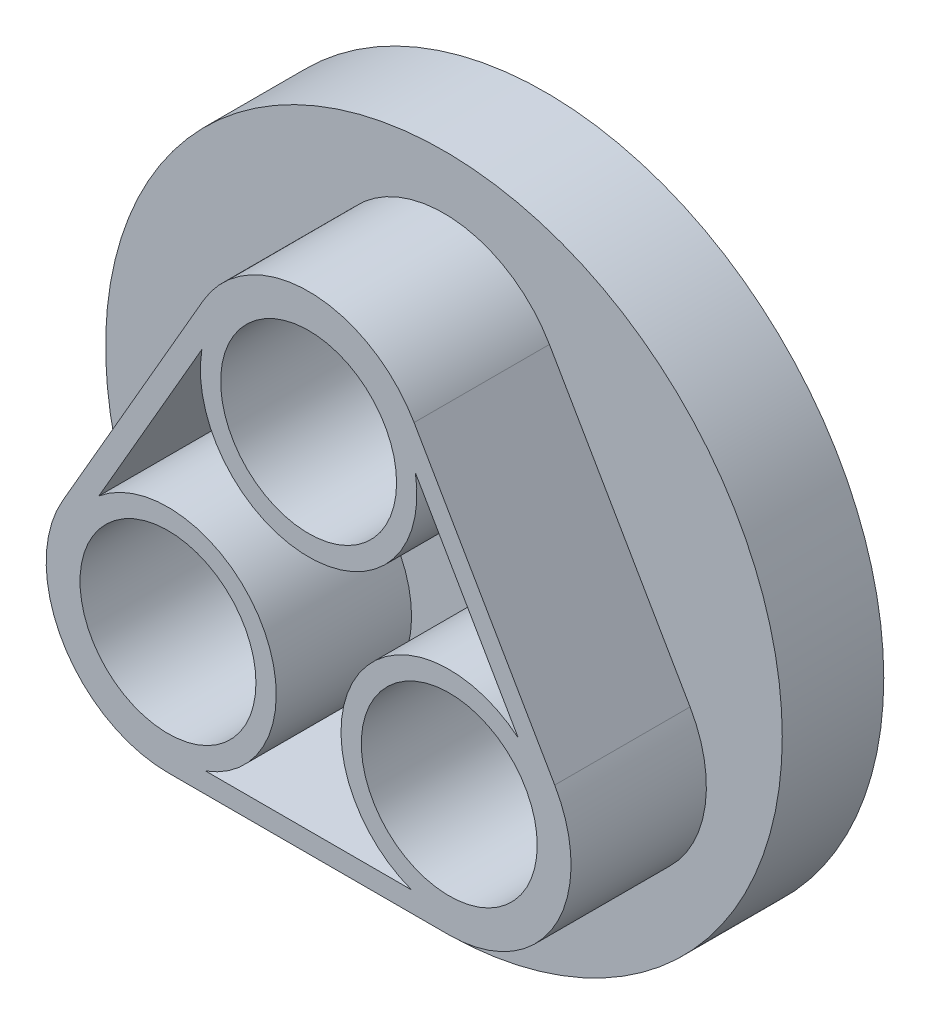
ISO-10303-21;
HEADER;
FILE_DESCRIPTION(('STEP AP214'),'2;1');
FILE_NAME('part.step','',(''),(''),'','','');
FILE_SCHEMA(('AUTOMOTIVE_DESIGN { 1 0 10303 214 1 1 1 1 }'));
ENDSEC;
DATA;
#1=APPLICATION_CONTEXT('core data for automotive mechanical design processes');
#2=APPLICATION_PROTOCOL_DEFINITION('international standard','automotive_design',2000,#1);
#3=PRODUCT_CONTEXT('',#1,'mechanical');
#4=PRODUCT('Part','Part','',(#3));
#5=PRODUCT_RELATED_PRODUCT_CATEGORY('part','',(#4));
#6=PRODUCT_DEFINITION_FORMATION('','',#4);
#7=PRODUCT_DEFINITION_CONTEXT('part definition',#1,'design');
#8=PRODUCT_DEFINITION('design','',#6,#7);
#9=PRODUCT_DEFINITION_SHAPE('','',#8);
#10=(LENGTH_UNIT() NAMED_UNIT(*) SI_UNIT(.MILLI.,.METRE.));
#11=(NAMED_UNIT(*) PLANE_ANGLE_UNIT() SI_UNIT($,.RADIAN.));
#12=(NAMED_UNIT(*) SI_UNIT($,.STERADIAN.) SOLID_ANGLE_UNIT());
#13=UNCERTAINTY_MEASURE_WITH_UNIT(LENGTH_MEASURE(1.E-05),#10,'distance_accuracy_value','');
#14=(GEOMETRIC_REPRESENTATION_CONTEXT(3) GLOBAL_UNCERTAINTY_ASSIGNED_CONTEXT((#13)) GLOBAL_UNIT_ASSIGNED_CONTEXT((#10,
#11,#12)) REPRESENTATION_CONTEXT('',''));
#15=CARTESIAN_POINT('',(0.,0.,0.));
#16=DIRECTION('',(0.,0.,1.));
#17=DIRECTION('',(1.,0.,0.));
#18=AXIS2_PLACEMENT_3D('',#15,#16,#17);
#19=CARTESIAN_POINT('',(0.,0.,12.));
#20=DIRECTION('',(0.,0.,1.));
#21=DIRECTION('',(1.,0.,0.));
#22=AXIS2_PLACEMENT_3D('',#19,#20,#21);
#23=PLANE('',#22);
#24=CARTESIAN_POINT('',(-20.7846096908265,-12.0000000000001,12.));
#25=DIRECTION('',(0.,0.,1.));
#26=DIRECTION('',(1.,0.,0.));
#27=AXIS2_PLACEMENT_3D('',#24,#25,#26);
#28=CIRCLE('',#27,16.);
#29=CARTESIAN_POINT('',(-4.78460969082647,-12.0000000000001,12.));
#30=VERTEX_POINT('',#29);
#31=EDGE_CURVE('E43',#30,#30,#28,.F.);
#32=ORIENTED_EDGE('',*,*,#31,.F.);
#33=EDGE_LOOP('',(#32));
#34=FACE_BOUND('',#33,.T.);
#35=CARTESIAN_POINT('',(0.,0.,12.));
#36=DIRECTION('',(0.,0.,1.));
#37=DIRECTION('',(1.,0.,0.));
#38=AXIS2_PLACEMENT_3D('',#35,#36,#37);
#39=CIRCLE('',#38,47.);
#40=CARTESIAN_POINT('',(47.,0.,12.));
#41=VERTEX_POINT('',#40);
#42=EDGE_CURVE('E255',#41,#41,#39,.T.);
#43=ORIENTED_EDGE('',*,*,#42,.F.);
#44=EDGE_LOOP('',(#43));
#45=FACE_BOUND('',#44,.T.);
#46=CARTESIAN_POINT('',(0.,24.,12.));
#47=DIRECTION('',(0.,0.,1.));
#48=DIRECTION('',(1.,0.,0.));
#49=AXIS2_PLACEMENT_3D('',#46,#47,#48);
#50=CIRCLE('',#49,16.);
#51=CARTESIAN_POINT('',(16.,24.,12.));
#52=VERTEX_POINT('',#51);
#53=EDGE_CURVE('E264',#52,#52,#50,.F.);
#54=ORIENTED_EDGE('',*,*,#53,.F.);
#55=EDGE_LOOP('',(#54));
#56=FACE_BOUND('',#55,.T.);
#57=CARTESIAN_POINT('',(20.7846096908266,-11.9999999999998,12.));
#58=DIRECTION('',(0.,0.,1.));
#59=DIRECTION('',(1.,0.,0.));
#60=AXIS2_PLACEMENT_3D('',#57,#58,#59);
#61=CIRCLE('',#60,16.);
#62=CARTESIAN_POINT('',(36.7846096908266,-11.9999999999998,12.));
#63=VERTEX_POINT('',#62);
#64=EDGE_CURVE('E11',#63,#63,#61,.F.);
#65=ORIENTED_EDGE('',*,*,#64,.F.);
#66=EDGE_LOOP('',(#65));
#67=FACE_BOUND('',#66,.T.);
#68=ADVANCED_FACE('F35',(#34,#45,#56,#67),#23,.F.);
#69=CARTESIAN_POINT('',(0.,0.,15.));
#70=DIRECTION('',(0.,0.,-1.));
#71=DIRECTION('',(-1.,0.,0.));
#72=AXIS2_PLACEMENT_3D('',#69,#70,#71);
#73=CYLINDRICAL_SURFACE('',#72,50.);
#74=CARTESIAN_POINT('',(0.,0.,15.));
#75=DIRECTION('',(0.,0.,1.));
#76=DIRECTION('',(1.,0.,0.));
#77=AXIS2_PLACEMENT_3D('',#74,#75,#76);
#78=CIRCLE('',#77,50.);
#79=CARTESIAN_POINT('',(50.,0.,15.));
#80=VERTEX_POINT('',#79);
#81=EDGE_CURVE('E261',#80,#80,#78,.T.);
#82=ORIENTED_EDGE('',*,*,#81,.F.);
#83=EDGE_LOOP('',(#82));
#84=FACE_BOUND('',#83,.T.);
#85=CARTESIAN_POINT('',(0.,0.,0.));
#86=DIRECTION('',(0.,0.,1.));
#87=DIRECTION('',(1.,0.,0.));
#88=AXIS2_PLACEMENT_3D('',#85,#86,#87);
#89=CIRCLE('',#88,50.);
#90=CARTESIAN_POINT('',(50.,0.,0.));
#91=VERTEX_POINT('',#90);
#92=EDGE_CURVE('E258',#91,#91,#89,.T.);
#93=ORIENTED_EDGE('',*,*,#92,.T.);
#94=EDGE_LOOP('',(#93));
#95=FACE_BOUND('',#94,.T.);
#96=ADVANCED_FACE('F37',(#84,#95),#73,.T.);
#97=CARTESIAN_POINT('',(0.,0.,15.));
#98=DIRECTION('',(0.,0.,1.));
#99=DIRECTION('',(1.,0.,0.));
#100=AXIS2_PLACEMENT_3D('',#97,#98,#99);
#101=PLANE('',#100);
#102=CARTESIAN_POINT('',(0.,24.,15.));
#103=DIRECTION('',(0.,0.,1.));
#104=DIRECTION('',(-1.,0.,0.));
#105=AXIS2_PLACEMENT_3D('',#102,#103,#104);
#106=CIRCLE('',#105,18.);
#107=CARTESIAN_POINT('',(15.5884572681199,33.,15.));
#108=VERTEX_POINT('',#107);
#109=CARTESIAN_POINT('',(-15.5884572681199,33.,15.));
#110=VERTEX_POINT('',#109);
#111=EDGE_CURVE('E58',#108,#110,#106,.T.);
#112=ORIENTED_EDGE('',*,*,#111,.F.);
#113=DIRECTION('',(-0.500000000000001,0.866025403784438,0.));
#114=VECTOR('',#113,1.);
#115=CARTESIAN_POINT('',(36.3730669589464,-2.99999999999998,15.));
#116=LINE('',#115,#114);
#117=CARTESIAN_POINT('',(36.3730669589464,-2.99999999999998,15.));
#118=VERTEX_POINT('',#117);
#119=EDGE_CURVE('E212',#118,#108,#116,.T.);
#120=ORIENTED_EDGE('',*,*,#119,.F.);
#121=CARTESIAN_POINT('',(20.7846096908265,-12.,15.));
#122=DIRECTION('',(0.,0.,1.));
#123=DIRECTION('',(-1.,0.,0.));
#124=AXIS2_PLACEMENT_3D('',#121,#122,#123);
#125=CIRCLE('',#124,18.);
#126=CARTESIAN_POINT('',(20.7846096908265,-30.,15.));
#127=VERTEX_POINT('',#126);
#128=EDGE_CURVE('E233',#127,#118,#125,.T.);
#129=ORIENTED_EDGE('',*,*,#128,.F.);
#130=DIRECTION('',(1.,0.,0.));
#131=VECTOR('',#130,1.);
#132=CARTESIAN_POINT('',(-20.7846096908265,-30.,15.));
#133=LINE('',#132,#131);
#134=CARTESIAN_POINT('',(-20.7846096908265,-30.,15.));
#135=VERTEX_POINT('',#134);
#136=EDGE_CURVE('E230',#135,#127,#133,.T.);
#137=ORIENTED_EDGE('',*,*,#136,.F.);
#138=CARTESIAN_POINT('',(-20.7846096908265,-12.,15.));
#139=DIRECTION('',(0.,0.,1.));
#140=DIRECTION('',(-1.,0.,0.));
#141=AXIS2_PLACEMENT_3D('',#138,#139,#140);
#142=CIRCLE('',#141,18.);
#143=CARTESIAN_POINT('',(-36.3730669589464,-3.00000000000001,15.));
#144=VERTEX_POINT('',#143);
#145=EDGE_CURVE('E227',#144,#135,#142,.T.);
#146=ORIENTED_EDGE('',*,*,#145,.F.);
#147=DIRECTION('',(-0.5,-0.866025403784439,0.));
#148=VECTOR('',#147,1.);
#149=CARTESIAN_POINT('',(-15.5884572681199,33.,15.));
#150=LINE('',#149,#148);
#151=EDGE_CURVE('E224',#110,#144,#150,.T.);
#152=ORIENTED_EDGE('',*,*,#151,.F.);
#153=EDGE_LOOP('',(#112,#120,#129,#137,#146,#152));
#154=FACE_BOUND('',#153,.T.);
#155=ORIENTED_EDGE('',*,*,#81,.T.);
#156=EDGE_LOOP('',(#155));
#157=FACE_BOUND('',#156,.T.);
#158=ADVANCED_FACE('F354',(#154,#157),#101,.T.);
#159=CARTESIAN_POINT('',(0.,0.,0.));
#160=DIRECTION('',(0.,0.,1.));
#161=DIRECTION('',(1.,0.,0.));
#162=AXIS2_PLACEMENT_3D('',#159,#160,#161);
#163=PLANE('',#162);
#164=CARTESIAN_POINT('',(0.,0.,0.));
#165=DIRECTION('',(0.,0.,1.));
#166=DIRECTION('',(1.,0.,0.));
#167=AXIS2_PLACEMENT_3D('',#164,#165,#166);
#168=CIRCLE('',#167,47.);
#169=CARTESIAN_POINT('',(47.,0.,0.));
#170=VERTEX_POINT('',#169);
#171=EDGE_CURVE('E254',#170,#170,#168,.T.);
#172=ORIENTED_EDGE('',*,*,#171,.T.);
#173=EDGE_LOOP('',(#172));
#174=FACE_BOUND('',#173,.T.);
#175=ORIENTED_EDGE('',*,*,#92,.F.);
#176=EDGE_LOOP('',(#175));
#177=FACE_BOUND('',#176,.T.);
#178=ADVANCED_FACE('F351',(#174,#177),#163,.F.);
#179=CARTESIAN_POINT('',(0.,0.,15.));
#180=DIRECTION('',(0.,0.,-1.));
#181=DIRECTION('',(-1.,0.,0.));
#182=AXIS2_PLACEMENT_3D('',#179,#180,#181);
#183=CYLINDRICAL_SURFACE('',#182,47.);
#184=ORIENTED_EDGE('',*,*,#42,.T.);
#185=EDGE_LOOP('',(#184));
#186=FACE_BOUND('',#185,.T.);
#187=ORIENTED_EDGE('',*,*,#171,.F.);
#188=EDGE_LOOP('',(#187));
#189=FACE_BOUND('',#188,.T.);
#190=ADVANCED_FACE('F348',(#186,#189),#183,.F.);
#191=CARTESIAN_POINT('',(0.,24.,35.));
#192=DIRECTION('',(0.,0.,-1.));
#193=DIRECTION('',(-1.,0.,0.));
#194=AXIS2_PLACEMENT_3D('',#191,#192,#193);
#195=CYLINDRICAL_SURFACE('',#194,18.);
#196=ORIENTED_EDGE('',*,*,#111,.T.);
#197=DIRECTION('',(0.,0.,-1.));
#198=VECTOR('',#197,1.);
#199=CARTESIAN_POINT('',(-15.5884572681199,33.,35.));
#200=LINE('',#199,#198);
#201=CARTESIAN_POINT('',(-15.5884572681199,33.,35.));
#202=VERTEX_POINT('',#201);
#203=EDGE_CURVE('E251',#202,#110,#200,.T.);
#204=ORIENTED_EDGE('',*,*,#203,.F.);
#205=CARTESIAN_POINT('',(0.,24.,35.));
#206=DIRECTION('',(0.,0.,1.));
#207=DIRECTION('',(-1.,0.,0.));
#208=AXIS2_PLACEMENT_3D('',#205,#206,#207);
#209=CIRCLE('',#208,18.);
#210=CARTESIAN_POINT('',(15.5884572681199,33.,35.));
#211=VERTEX_POINT('',#210);
#212=EDGE_CURVE('E208',#211,#202,#209,.T.);
#213=ORIENTED_EDGE('',*,*,#212,.F.);
#214=DIRECTION('',(0.,0.,-1.));
#215=VECTOR('',#214,1.);
#216=CARTESIAN_POINT('',(15.5884572681199,33.,35.));
#217=LINE('',#216,#215);
#218=EDGE_CURVE('E222',#211,#108,#217,.T.);
#219=ORIENTED_EDGE('',*,*,#218,.T.);
#220=EDGE_LOOP('',(#196,#204,#213,#219));
#221=FACE_BOUND('',#220,.T.);
#222=ADVANCED_FACE('F344',(#221),#195,.T.);
#223=CARTESIAN_POINT('',(-15.5884572681199,33.,35.));
#224=DIRECTION('',(0.866025403784439,-0.5,0.));
#225=DIRECTION('',(0.5,0.866025403784439,0.));
#226=AXIS2_PLACEMENT_3D('',#223,#224,#225);
#227=PLANE('',#226);
#228=ORIENTED_EDGE('',*,*,#151,.T.);
#229=DIRECTION('',(0.,0.,-1.));
#230=VECTOR('',#229,1.);
#231=CARTESIAN_POINT('',(-36.3730669589464,-3.00000000000001,35.));
#232=LINE('',#231,#230);
#233=CARTESIAN_POINT('',(-36.3730669589464,-3.00000000000001,35.));
#234=VERTEX_POINT('',#233);
#235=EDGE_CURVE('E248',#234,#144,#232,.T.);
#236=ORIENTED_EDGE('',*,*,#235,.F.);
#237=DIRECTION('',(-0.5,-0.866025403784439,0.));
#238=VECTOR('',#237,1.);
#239=CARTESIAN_POINT('',(-15.5884572681199,33.,35.));
#240=LINE('',#239,#238);
#241=EDGE_CURVE('E211',#202,#234,#240,.T.);
#242=ORIENTED_EDGE('',*,*,#241,.F.);
#243=ORIENTED_EDGE('',*,*,#203,.T.);
#244=EDGE_LOOP('',(#228,#236,#242,#243));
#245=FACE_BOUND('',#244,.T.);
#246=ADVANCED_FACE('F340',(#245),#227,.F.);
#247=CARTESIAN_POINT('',(-20.7846096908265,-12.,35.));
#248=DIRECTION('',(0.,0.,-1.));
#249=DIRECTION('',(-1.,0.,0.));
#250=AXIS2_PLACEMENT_3D('',#247,#248,#249);
#251=CYLINDRICAL_SURFACE('',#250,18.);
#252=ORIENTED_EDGE('',*,*,#145,.T.);
#253=DIRECTION('',(0.,0.,-1.));
#254=VECTOR('',#253,1.);
#255=CARTESIAN_POINT('',(-20.7846096908265,-30.,35.));
#256=LINE('',#255,#254);
#257=CARTESIAN_POINT('',(-20.7846096908265,-30.,35.));
#258=VERTEX_POINT('',#257);
#259=EDGE_CURVE('E245',#258,#135,#256,.T.);
#260=ORIENTED_EDGE('',*,*,#259,.F.);
#261=CARTESIAN_POINT('',(-20.7846096908265,-12.,35.));
#262=DIRECTION('',(0.,0.,1.));
#263=DIRECTION('',(-1.,0.,0.));
#264=AXIS2_PLACEMENT_3D('',#261,#262,#263);
#265=CIRCLE('',#264,18.);
#266=EDGE_CURVE('E214',#234,#258,#265,.T.);
#267=ORIENTED_EDGE('',*,*,#266,.F.);
#268=ORIENTED_EDGE('',*,*,#235,.T.);
#269=EDGE_LOOP('',(#252,#260,#267,#268));
#270=FACE_BOUND('',#269,.T.);
#271=ADVANCED_FACE('F336',(#270),#251,.T.);
#272=CARTESIAN_POINT('',(-20.7846096908265,-30.,35.));
#273=DIRECTION('',(0.,1.,0.));
#274=DIRECTION('',(-1.,0.,0.));
#275=AXIS2_PLACEMENT_3D('',#272,#273,#274);
#276=PLANE('',#275);
#277=ORIENTED_EDGE('',*,*,#136,.T.);
#278=DIRECTION('',(0.,0.,-1.));
#279=VECTOR('',#278,1.);
#280=CARTESIAN_POINT('',(20.7846096908265,-30.,35.));
#281=LINE('',#280,#279);
#282=CARTESIAN_POINT('',(20.7846096908265,-30.,35.));
#283=VERTEX_POINT('',#282);
#284=EDGE_CURVE('E242',#283,#127,#281,.T.);
#285=ORIENTED_EDGE('',*,*,#284,.F.);
#286=DIRECTION('',(1.,0.,0.));
#287=VECTOR('',#286,1.);
#288=CARTESIAN_POINT('',(-20.7846096908265,-30.,35.));
#289=LINE('',#288,#287);
#290=EDGE_CURVE('E216',#258,#283,#289,.T.);
#291=ORIENTED_EDGE('',*,*,#290,.F.);
#292=ORIENTED_EDGE('',*,*,#259,.T.);
#293=EDGE_LOOP('',(#277,#285,#291,#292));
#294=FACE_BOUND('',#293,.T.);
#295=ADVANCED_FACE('F332',(#294),#276,.F.);
#296=CARTESIAN_POINT('',(20.7846096908265,-12.,35.));
#297=DIRECTION('',(0.,0.,-1.));
#298=DIRECTION('',(-1.,0.,0.));
#299=AXIS2_PLACEMENT_3D('',#296,#297,#298);
#300=CYLINDRICAL_SURFACE('',#299,18.);
#301=ORIENTED_EDGE('',*,*,#128,.T.);
#302=DIRECTION('',(0.,0.,-1.));
#303=VECTOR('',#302,1.);
#304=CARTESIAN_POINT('',(36.3730669589464,-2.99999999999998,35.));
#305=LINE('',#304,#303);
#306=CARTESIAN_POINT('',(36.3730669589464,-2.99999999999998,35.));
#307=VERTEX_POINT('',#306);
#308=EDGE_CURVE('E239',#307,#118,#305,.T.);
#309=ORIENTED_EDGE('',*,*,#308,.F.);
#310=CARTESIAN_POINT('',(20.7846096908265,-12.,35.));
#311=DIRECTION('',(0.,0.,1.));
#312=DIRECTION('',(-1.,0.,0.));
#313=AXIS2_PLACEMENT_3D('',#310,#311,#312);
#314=CIRCLE('',#313,18.);
#315=EDGE_CURVE('E218',#283,#307,#314,.T.);
#316=ORIENTED_EDGE('',*,*,#315,.F.);
#317=ORIENTED_EDGE('',*,*,#284,.T.);
#318=EDGE_LOOP('',(#301,#309,#316,#317));
#319=FACE_BOUND('',#318,.T.);
#320=ADVANCED_FACE('F328',(#319),#300,.T.);
#321=CARTESIAN_POINT('',(36.3730669589464,-2.99999999999998,35.));
#322=DIRECTION('',(-0.866025403784438,-0.500000000000001,0.));
#323=DIRECTION('',(0.500000000000001,-0.866025403784438,0.));
#324=AXIS2_PLACEMENT_3D('',#321,#322,#323);
#325=PLANE('',#324);
#326=ORIENTED_EDGE('',*,*,#119,.T.);
#327=ORIENTED_EDGE('',*,*,#218,.F.);
#328=DIRECTION('',(-0.500000000000001,0.866025403784438,0.));
#329=VECTOR('',#328,1.);
#330=CARTESIAN_POINT('',(36.3730669589464,-2.99999999999998,35.));
#331=LINE('',#330,#329);
#332=EDGE_CURVE('E220',#307,#211,#331,.T.);
#333=ORIENTED_EDGE('',*,*,#332,.F.);
#334=ORIENTED_EDGE('',*,*,#308,.T.);
#335=EDGE_LOOP('',(#326,#327,#333,#334));
#336=FACE_BOUND('',#335,.T.);
#337=ADVANCED_FACE('F325',(#336),#325,.F.);
#338=CARTESIAN_POINT('',(0.,24.,35.));
#339=DIRECTION('',(0.,0.,-1.));
#340=DIRECTION('',(-1.,0.,0.));
#341=AXIS2_PLACEMENT_3D('',#338,#339,#340);
#342=PLANE('',#341);
#343=DIRECTION('',(1.,0.,0.));
#344=VECTOR('',#343,1.);
#345=CARTESIAN_POINT('',(0.,-27.,35.));
#346=LINE('',#345,#344);
#347=CARTESIAN_POINT('',(-15.2168453279965,-27.,35.));
#348=VERTEX_POINT('',#347);
#349=CARTESIAN_POINT('',(15.2168453279965,-27.,35.));
#350=VERTEX_POINT('',#349);
#351=EDGE_CURVE('E146',#348,#350,#346,.T.);
#352=ORIENTED_EDGE('',*,*,#351,.F.);
#353=CARTESIAN_POINT('',(-20.7846096908265,-12.,35.));
#354=DIRECTION('',(0.,0.,-1.));
#355=DIRECTION('',(-1.,0.,0.));
#356=AXIS2_PLACEMENT_3D('',#353,#354,#355);
#357=CIRCLE('',#356,16.);
#358=CARTESIAN_POINT('',(-30.9911085661781,0.321825380496459,35.));
#359=VERTEX_POINT('',#358);
#360=EDGE_CURVE('E152',#348,#359,#357,.F.);
#361=ORIENTED_EDGE('',*,*,#360,.T.);
#362=DIRECTION('',(-0.5,-0.866025403784439,0.));
#363=VECTOR('',#362,1.);
#364=CARTESIAN_POINT('',(-12.9903810567666,31.5,35.));
#365=LINE('',#364,#363);
#366=CARTESIAN_POINT('',(-15.7742632381816,26.6781746195035,35.));
#367=VERTEX_POINT('',#366);
#368=EDGE_CURVE('E50',#367,#359,#365,.T.);
#369=ORIENTED_EDGE('',*,*,#368,.F.);
#370=CARTESIAN_POINT('',(0.,24.,35.));
#371=DIRECTION('',(0.,0.,-1.));
#372=DIRECTION('',(-1.,0.,0.));
#373=AXIS2_PLACEMENT_3D('',#370,#371,#372);
#374=CIRCLE('',#373,16.);
#375=CARTESIAN_POINT('',(15.7742632381816,26.6781746195035,35.));
#376=VERTEX_POINT('',#375);
#377=EDGE_CURVE('E130',#367,#376,#374,.F.);
#378=ORIENTED_EDGE('',*,*,#377,.T.);
#379=DIRECTION('',(-0.500000000000001,0.866025403784438,0.));
#380=VECTOR('',#379,1.);
#381=CARTESIAN_POINT('',(12.9903810567666,31.5,35.));
#382=LINE('',#381,#380);
#383=CARTESIAN_POINT('',(30.9911085661781,0.321825380496455,35.));
#384=VERTEX_POINT('',#383);
#385=EDGE_CURVE('E138',#384,#376,#382,.T.);
#386=ORIENTED_EDGE('',*,*,#385,.F.);
#387=CARTESIAN_POINT('',(20.7846096908265,-12.,35.));
#388=DIRECTION('',(0.,0.,-1.));
#389=DIRECTION('',(-1.,0.,0.));
#390=AXIS2_PLACEMENT_3D('',#387,#388,#389);
#391=CIRCLE('',#390,16.);
#392=EDGE_CURVE('E155',#384,#350,#391,.F.);
#393=ORIENTED_EDGE('',*,*,#392,.T.);
#394=EDGE_LOOP('',(#352,#361,#369,#378,#386,#393));
#395=FACE_BOUND('',#394,.T.);
#396=CARTESIAN_POINT('',(0.,24.,35.));
#397=DIRECTION('',(0.,0.,1.));
#398=DIRECTION('',(1.,0.,0.));
#399=AXIS2_PLACEMENT_3D('',#396,#397,#398);
#400=CIRCLE('',#399,13.);
#401=CARTESIAN_POINT('',(13.,24.,35.));
#402=VERTEX_POINT('',#401);
#403=EDGE_CURVE('E200',#402,#402,#400,.T.);
#404=ORIENTED_EDGE('',*,*,#403,.F.);
#405=EDGE_LOOP('',(#404));
#406=FACE_BOUND('',#405,.T.);
#407=CARTESIAN_POINT('',(-20.7846096908265,-12.,35.));
#408=DIRECTION('',(0.,0.,1.));
#409=DIRECTION('',(1.,0.,0.));
#410=AXIS2_PLACEMENT_3D('',#407,#408,#409);
#411=CIRCLE('',#410,13.);
#412=CARTESIAN_POINT('',(-7.78460969082651,-12.,35.));
#413=VERTEX_POINT('',#412);
#414=EDGE_CURVE('E203',#413,#413,#411,.T.);
#415=ORIENTED_EDGE('',*,*,#414,.F.);
#416=EDGE_LOOP('',(#415));
#417=FACE_BOUND('',#416,.T.);
#418=CARTESIAN_POINT('',(20.7846096908265,-12.,35.));
#419=DIRECTION('',(0.,0.,1.));
#420=DIRECTION('',(1.,0.,0.));
#421=AXIS2_PLACEMENT_3D('',#418,#419,#420);
#422=CIRCLE('',#421,13.);
#423=CARTESIAN_POINT('',(33.7846096908265,-12.,35.));
#424=VERTEX_POINT('',#423);
#425=EDGE_CURVE('E199',#424,#424,#422,.T.);
#426=ORIENTED_EDGE('',*,*,#425,.F.);
#427=EDGE_LOOP('',(#426));
#428=FACE_BOUND('',#427,.T.);
#429=ORIENTED_EDGE('',*,*,#212,.T.);
#430=ORIENTED_EDGE('',*,*,#241,.T.);
#431=ORIENTED_EDGE('',*,*,#266,.T.);
#432=ORIENTED_EDGE('',*,*,#290,.T.);
#433=ORIENTED_EDGE('',*,*,#315,.T.);
#434=ORIENTED_EDGE('',*,*,#332,.T.);
#435=EDGE_LOOP('',(#429,#430,#431,#432,#433,#434));
#436=FACE_BOUND('',#435,.T.);
#437=ADVANCED_FACE('F149',(#395,#406,#417,#428,#436),#342,.F.);
#438=CARTESIAN_POINT('',(20.7846096908265,-12.,0.));
#439=DIRECTION('',(0.,0.,1.));
#440=DIRECTION('',(1.,0.,0.));
#441=AXIS2_PLACEMENT_3D('',#438,#439,#440);
#442=CYLINDRICAL_SURFACE('',#441,13.);
#443=ORIENTED_EDGE('',*,*,#425,.T.);
#444=EDGE_LOOP('',(#443));
#445=FACE_BOUND('',#444,.T.);
#446=CARTESIAN_POINT('',(20.7846096908266,-11.9999999999998,0.));
#447=DIRECTION('',(0.,0.,1.));
#448=DIRECTION('',(1.,0.,0.));
#449=AXIS2_PLACEMENT_3D('',#446,#447,#448);
#450=CIRCLE('',#449,13.);
#451=CARTESIAN_POINT('',(33.7846096908266,-11.9999999999998,0.));
#452=VERTEX_POINT('',#451);
#453=EDGE_CURVE('E184',#452,#452,#450,.T.);
#454=ORIENTED_EDGE('',*,*,#453,.F.);
#455=EDGE_LOOP('',(#454));
#456=FACE_BOUND('',#455,.T.);
#457=ADVANCED_FACE('F318',(#445,#456),#442,.F.);
#458=CARTESIAN_POINT('',(-20.7846096908265,-12.,0.));
#459=DIRECTION('',(0.,0.,1.));
#460=DIRECTION('',(1.,0.,0.));
#461=AXIS2_PLACEMENT_3D('',#458,#459,#460);
#462=CYLINDRICAL_SURFACE('',#461,13.);
#463=ORIENTED_EDGE('',*,*,#414,.T.);
#464=EDGE_LOOP('',(#463));
#465=FACE_BOUND('',#464,.T.);
#466=CARTESIAN_POINT('',(-20.7846096908265,-12.0000000000001,0.));
#467=DIRECTION('',(0.,0.,1.));
#468=DIRECTION('',(1.,0.,0.));
#469=AXIS2_PLACEMENT_3D('',#466,#467,#468);
#470=CIRCLE('',#469,13.);
#471=CARTESIAN_POINT('',(-7.78460969082647,-12.0000000000001,0.));
#472=VERTEX_POINT('',#471);
#473=EDGE_CURVE('E190',#472,#472,#470,.T.);
#474=ORIENTED_EDGE('',*,*,#473,.F.);
#475=EDGE_LOOP('',(#474));
#476=FACE_BOUND('',#475,.T.);
#477=ADVANCED_FACE('F314',(#465,#476),#462,.F.);
#478=CARTESIAN_POINT('',(0.,24.,0.));
#479=DIRECTION('',(0.,0.,1.));
#480=DIRECTION('',(1.,0.,0.));
#481=AXIS2_PLACEMENT_3D('',#478,#479,#480);
#482=CYLINDRICAL_SURFACE('',#481,13.);
#483=ORIENTED_EDGE('',*,*,#403,.T.);
#484=EDGE_LOOP('',(#483));
#485=FACE_BOUND('',#484,.T.);
#486=CARTESIAN_POINT('',(0.,24.,0.));
#487=DIRECTION('',(0.,0.,1.));
#488=DIRECTION('',(1.,0.,0.));
#489=AXIS2_PLACEMENT_3D('',#486,#487,#488);
#490=CIRCLE('',#489,13.);
#491=CARTESIAN_POINT('',(13.,24.,0.));
#492=VERTEX_POINT('',#491);
#493=EDGE_CURVE('E196',#492,#492,#490,.T.);
#494=ORIENTED_EDGE('',*,*,#493,.F.);
#495=EDGE_LOOP('',(#494));
#496=FACE_BOUND('',#495,.T.);
#497=ADVANCED_FACE('F307',(#485,#496),#482,.F.);
#498=CARTESIAN_POINT('',(0.,24.,-45.254833995939));
#499=DIRECTION('',(0.,0.,1.));
#500=DIRECTION('',(1.,0.,0.));
#501=AXIS2_PLACEMENT_3D('',#498,#499,#500);
#502=CYLINDRICAL_SURFACE('',#501,16.);
#503=CARTESIAN_POINT('',(0.,24.,0.));
#504=DIRECTION('',(0.,0.,1.));
#505=DIRECTION('',(1.,0.,0.));
#506=AXIS2_PLACEMENT_3D('',#503,#504,#505);
#507=CIRCLE('',#506,16.);
#508=CARTESIAN_POINT('',(16.,24.,0.));
#509=VERTEX_POINT('',#508);
#510=EDGE_CURVE('E193',#509,#509,#507,.T.);
#511=ORIENTED_EDGE('',*,*,#510,.T.);
#512=EDGE_LOOP('',(#511));
#513=FACE_BOUND('',#512,.T.);
#514=ORIENTED_EDGE('',*,*,#53,.T.);
#515=EDGE_LOOP('',(#514));
#516=FACE_BOUND('',#515,.T.);
#517=ADVANCED_FACE('F304',(#513,#516),#502,.T.);
#518=CARTESIAN_POINT('',(0.,0.,0.));
#519=DIRECTION('',(0.,0.,1.));
#520=DIRECTION('',(1.,0.,0.));
#521=AXIS2_PLACEMENT_3D('',#518,#519,#520);
#522=PLANE('',#521);
#523=ORIENTED_EDGE('',*,*,#493,.T.);
#524=EDGE_LOOP('',(#523));
#525=FACE_BOUND('',#524,.T.);
#526=ORIENTED_EDGE('',*,*,#510,.F.);
#527=EDGE_LOOP('',(#526));
#528=FACE_BOUND('',#527,.T.);
#529=ADVANCED_FACE('F301',(#525,#528),#522,.F.);
#530=CARTESIAN_POINT('',(-20.7846096908265,-12.0000000000001,-45.254833995939));
#531=DIRECTION('',(0.,0.,1.));
#532=DIRECTION('',(1.,0.,0.));
#533=AXIS2_PLACEMENT_3D('',#530,#531,#532);
#534=CYLINDRICAL_SURFACE('',#533,16.);
#535=CARTESIAN_POINT('',(-20.7846096908265,-12.0000000000001,0.));
#536=DIRECTION('',(0.,0.,1.));
#537=DIRECTION('',(1.,0.,0.));
#538=AXIS2_PLACEMENT_3D('',#535,#536,#537);
#539=CIRCLE('',#538,16.);
#540=CARTESIAN_POINT('',(-4.78460969082647,-12.0000000000001,0.));
#541=VERTEX_POINT('',#540);
#542=EDGE_CURVE('E187',#541,#541,#539,.T.);
#543=ORIENTED_EDGE('',*,*,#542,.T.);
#544=EDGE_LOOP('',(#543));
#545=FACE_BOUND('',#544,.T.);
#546=ORIENTED_EDGE('',*,*,#31,.T.);
#547=EDGE_LOOP('',(#546));
#548=FACE_BOUND('',#547,.T.);
#549=ADVANCED_FACE('F271',(#545,#548),#534,.T.);
#550=CARTESIAN_POINT('',(0.,0.,0.));
#551=DIRECTION('',(0.,0.,1.));
#552=DIRECTION('',(1.,0.,0.));
#553=AXIS2_PLACEMENT_3D('',#550,#551,#552);
#554=PLANE('',#553);
#555=ORIENTED_EDGE('',*,*,#473,.T.);
#556=EDGE_LOOP('',(#555));
#557=FACE_BOUND('',#556,.T.);
#558=ORIENTED_EDGE('',*,*,#542,.F.);
#559=EDGE_LOOP('',(#558));
#560=FACE_BOUND('',#559,.T.);
#561=ADVANCED_FACE('F285',(#557,#560),#554,.F.);
#562=CARTESIAN_POINT('',(20.7846096908266,-11.9999999999998,-45.254833995939));
#563=DIRECTION('',(0.,0.,1.));
#564=DIRECTION('',(1.,0.,0.));
#565=AXIS2_PLACEMENT_3D('',#562,#563,#564);
#566=CYLINDRICAL_SURFACE('',#565,16.);
#567=CARTESIAN_POINT('',(20.7846096908266,-11.9999999999998,0.));
#568=DIRECTION('',(0.,0.,1.));
#569=DIRECTION('',(1.,0.,0.));
#570=AXIS2_PLACEMENT_3D('',#567,#568,#569);
#571=CIRCLE('',#570,16.);
#572=CARTESIAN_POINT('',(36.7846096908266,-11.9999999999998,0.));
#573=VERTEX_POINT('',#572);
#574=EDGE_CURVE('E181',#573,#573,#571,.T.);
#575=ORIENTED_EDGE('',*,*,#574,.T.);
#576=EDGE_LOOP('',(#575));
#577=FACE_BOUND('',#576,.T.);
#578=ORIENTED_EDGE('',*,*,#64,.T.);
#579=EDGE_LOOP('',(#578));
#580=FACE_BOUND('',#579,.T.);
#581=ADVANCED_FACE('F282',(#577,#580),#566,.T.);
#582=CARTESIAN_POINT('',(0.,0.,0.));
#583=DIRECTION('',(0.,0.,1.));
#584=DIRECTION('',(1.,0.,0.));
#585=AXIS2_PLACEMENT_3D('',#582,#583,#584);
#586=PLANE('',#585);
#587=ORIENTED_EDGE('',*,*,#453,.T.);
#588=EDGE_LOOP('',(#587));
#589=FACE_BOUND('',#588,.T.);
#590=ORIENTED_EDGE('',*,*,#574,.F.);
#591=EDGE_LOOP('',(#590));
#592=FACE_BOUND('',#591,.T.);
#593=ADVANCED_FACE('F284',(#589,#592),#586,.F.);
#594=CARTESIAN_POINT('',(20.7846096908265,-12.,0.));
#595=DIRECTION('',(0.,0.,1.));
#596=DIRECTION('',(1.,0.,0.));
#597=AXIS2_PLACEMENT_3D('',#594,#595,#596);
#598=CYLINDRICAL_SURFACE('',#597,16.);
#599=CARTESIAN_POINT('',(20.7846096908265,-12.,15.));
#600=DIRECTION('',(0.,0.,1.));
#601=DIRECTION('',(1.,0.,0.));
#602=AXIS2_PLACEMENT_3D('',#599,#600,#601);
#603=CIRCLE('',#602,16.);
#604=CARTESIAN_POINT('',(30.9911085661781,0.321825380496457,15.));
#605=VERTEX_POINT('',#604);
#606=CARTESIAN_POINT('',(15.2168453279965,-27.,15.));
#607=VERTEX_POINT('',#606);
#608=EDGE_CURVE('E178',#605,#607,#603,.T.);
#609=ORIENTED_EDGE('',*,*,#608,.T.);
#610=DIRECTION('',(0.,0.,1.));
#611=VECTOR('',#610,1.);
#612=CARTESIAN_POINT('',(15.2168453279965,-27.,0.));
#613=LINE('',#612,#611);
#614=EDGE_CURVE('E145',#350,#607,#613,.F.);
#615=ORIENTED_EDGE('',*,*,#614,.F.);
#616=ORIENTED_EDGE('',*,*,#392,.F.);
#617=DIRECTION('',(0.,0.,1.));
#618=VECTOR('',#617,1.);
#619=CARTESIAN_POINT('',(30.9911085661781,0.321825380496465,0.));
#620=LINE('',#619,#618);
#621=EDGE_CURVE('E141',#384,#605,#620,.F.);
#622=ORIENTED_EDGE('',*,*,#621,.T.);
#623=EDGE_LOOP('',(#609,#615,#616,#622));
#624=FACE_BOUND('',#623,.T.);
#625=ADVANCED_FACE('F292',(#624),#598,.T.);
#626=CARTESIAN_POINT('',(0.,0.,15.));
#627=DIRECTION('',(0.,0.,1.));
#628=DIRECTION('',(1.,0.,0.));
#629=AXIS2_PLACEMENT_3D('',#626,#627,#628);
#630=PLANE('',#629);
#631=DIRECTION('',(0.500000000000001,-0.866025403784438,0.));
#632=VECTOR('',#631,1.);
#633=CARTESIAN_POINT('',(23.3826859021798,13.5,15.));
#634=LINE('',#633,#632);
#635=CARTESIAN_POINT('',(15.7742632381816,26.6781746195035,15.));
#636=VERTEX_POINT('',#635);
#637=EDGE_CURVE('E172',#636,#605,#634,.T.);
#638=ORIENTED_EDGE('',*,*,#637,.F.);
#639=CARTESIAN_POINT('',(0.,24.,15.));
#640=DIRECTION('',(0.,0.,1.));
#641=DIRECTION('',(1.,0.,0.));
#642=AXIS2_PLACEMENT_3D('',#639,#640,#641);
#643=CIRCLE('',#642,16.);
#644=CARTESIAN_POINT('',(-15.7742632381816,26.6781746195035,15.));
#645=VERTEX_POINT('',#644);
#646=EDGE_CURVE('E132',#645,#636,#643,.T.);
#647=ORIENTED_EDGE('',*,*,#646,.F.);
#648=DIRECTION('',(0.5,0.866025403784439,0.));
#649=VECTOR('',#648,1.);
#650=CARTESIAN_POINT('',(-23.3826859021798,13.5,15.));
#651=LINE('',#650,#649);
#652=CARTESIAN_POINT('',(-30.9911085661781,0.321825380496459,15.));
#653=VERTEX_POINT('',#652);
#654=EDGE_CURVE('E170',#653,#645,#651,.T.);
#655=ORIENTED_EDGE('',*,*,#654,.F.);
#656=CARTESIAN_POINT('',(-20.7846096908265,-12.,15.));
#657=DIRECTION('',(0.,0.,1.));
#658=DIRECTION('',(1.,0.,0.));
#659=AXIS2_PLACEMENT_3D('',#656,#657,#658);
#660=CIRCLE('',#659,16.);
#661=CARTESIAN_POINT('',(-15.2168453279965,-27.,15.));
#662=VERTEX_POINT('',#661);
#663=EDGE_CURVE('E174',#662,#653,#660,.T.);
#664=ORIENTED_EDGE('',*,*,#663,.F.);
#665=DIRECTION('',(-1.,0.,0.));
#666=VECTOR('',#665,1.);
#667=CARTESIAN_POINT('',(0.,-27.,15.));
#668=LINE('',#667,#666);
#669=EDGE_CURVE('E176',#607,#662,#668,.T.);
#670=ORIENTED_EDGE('',*,*,#669,.F.);
#671=ORIENTED_EDGE('',*,*,#608,.F.);
#672=EDGE_LOOP('',(#638,#647,#655,#664,#670,#671));
#673=FACE_BOUND('',#672,.T.);
#674=ADVANCED_FACE('F495',(#673),#630,.T.);
#675=CARTESIAN_POINT('',(33.7749907475931,-4.49999999999998,35.));
#676=DIRECTION('',(-0.866025403784438,-0.500000000000001,0.));
#677=DIRECTION('',(0.500000000000001,-0.866025403784438,0.));
#678=AXIS2_PLACEMENT_3D('',#675,#676,#677);
#679=PLANE('',#678);
#680=ORIENTED_EDGE('',*,*,#637,.T.);
#681=ORIENTED_EDGE('',*,*,#621,.F.);
#682=ORIENTED_EDGE('',*,*,#385,.T.);
#683=DIRECTION('',(0.,0.,1.));
#684=VECTOR('',#683,1.);
#685=CARTESIAN_POINT('',(15.7742632381816,26.6781746195035,0.));
#686=LINE('',#685,#684);
#687=EDGE_CURVE('E125',#376,#636,#686,.F.);
#688=ORIENTED_EDGE('',*,*,#687,.T.);
#689=EDGE_LOOP('',(#680,#681,#682,#688));
#690=FACE_BOUND('',#689,.T.);
#691=ADVANCED_FACE('F139',(#690),#679,.T.);
#692=CARTESIAN_POINT('',(0.,24.,0.));
#693=DIRECTION('',(0.,0.,1.));
#694=DIRECTION('',(1.,0.,0.));
#695=AXIS2_PLACEMENT_3D('',#692,#693,#694);
#696=CYLINDRICAL_SURFACE('',#695,16.);
#697=ORIENTED_EDGE('',*,*,#646,.T.);
#698=ORIENTED_EDGE('',*,*,#687,.F.);
#699=ORIENTED_EDGE('',*,*,#377,.F.);
#700=DIRECTION('',(0.,0.,1.));
#701=VECTOR('',#700,1.);
#702=CARTESIAN_POINT('',(-15.7742632381816,26.6781746195035,0.));
#703=LINE('',#702,#701);
#704=EDGE_CURVE('E135',#367,#645,#703,.F.);
#705=ORIENTED_EDGE('',*,*,#704,.T.);
#706=EDGE_LOOP('',(#697,#698,#699,#705));
#707=FACE_BOUND('',#706,.T.);
#708=ADVANCED_FACE('F127',(#707),#696,.T.);
#709=CARTESIAN_POINT('',(-12.9903810567666,31.5,35.));
#710=DIRECTION('',(0.866025403784439,-0.5,0.));
#711=DIRECTION('',(0.5,0.866025403784439,0.));
#712=AXIS2_PLACEMENT_3D('',#709,#710,#711);
#713=PLANE('',#712);
#714=ORIENTED_EDGE('',*,*,#654,.T.);
#715=ORIENTED_EDGE('',*,*,#704,.F.);
#716=ORIENTED_EDGE('',*,*,#368,.T.);
#717=DIRECTION('',(0.,0.,1.));
#718=VECTOR('',#717,1.);
#719=CARTESIAN_POINT('',(-30.9911085661781,0.321825380496466,0.));
#720=LINE('',#719,#718);
#721=EDGE_CURVE('E163',#359,#653,#720,.F.);
#722=ORIENTED_EDGE('',*,*,#721,.T.);
#723=EDGE_LOOP('',(#714,#715,#716,#722));
#724=FACE_BOUND('',#723,.T.);
#725=ADVANCED_FACE('F525',(#724),#713,.T.);
#726=CARTESIAN_POINT('',(-20.7846096908265,-27.,35.));
#727=DIRECTION('',(0.,1.,0.));
#728=DIRECTION('',(-1.,0.,0.));
#729=AXIS2_PLACEMENT_3D('',#726,#727,#728);
#730=PLANE('',#729);
#731=ORIENTED_EDGE('',*,*,#669,.T.);
#732=DIRECTION('',(0.,0.,1.));
#733=VECTOR('',#732,1.);
#734=CARTESIAN_POINT('',(-15.2168453279965,-27.,0.));
#735=LINE('',#734,#733);
#736=EDGE_CURVE('E165',#348,#662,#735,.F.);
#737=ORIENTED_EDGE('',*,*,#736,.F.);
#738=ORIENTED_EDGE('',*,*,#351,.T.);
#739=ORIENTED_EDGE('',*,*,#614,.T.);
#740=EDGE_LOOP('',(#731,#737,#738,#739));
#741=FACE_BOUND('',#740,.T.);
#742=ADVANCED_FACE('F533',(#741),#730,.T.);
#743=CARTESIAN_POINT('',(-20.7846096908265,-12.,0.));
#744=DIRECTION('',(0.,0.,1.));
#745=DIRECTION('',(1.,0.,0.));
#746=AXIS2_PLACEMENT_3D('',#743,#744,#745);
#747=CYLINDRICAL_SURFACE('',#746,16.);
#748=ORIENTED_EDGE('',*,*,#663,.T.);
#749=ORIENTED_EDGE('',*,*,#721,.F.);
#750=ORIENTED_EDGE('',*,*,#360,.F.);
#751=ORIENTED_EDGE('',*,*,#736,.T.);
#752=EDGE_LOOP('',(#748,#749,#750,#751));
#753=FACE_BOUND('',#752,.T.);
#754=ADVANCED_FACE('F541',(#753),#747,.T.);
#755=CLOSED_SHELL('',(#68,#96,#158,#178,#190,#222,#246,#271,#295,#320,#337,#437,#457,#477,#497,
#517,#529,#549,#561,#581,#593,#625,#674,#691,#708,#725,#742,#754));
#756=MANIFOLD_SOLID_BREP('B2',#755);
#757=ADVANCED_BREP_SHAPE_REPRESENTATION('',(#18,#756),#14);
#758=SHAPE_DEFINITION_REPRESENTATION(#9,#757);
ENDSEC;
END-ISO-10303-21;
